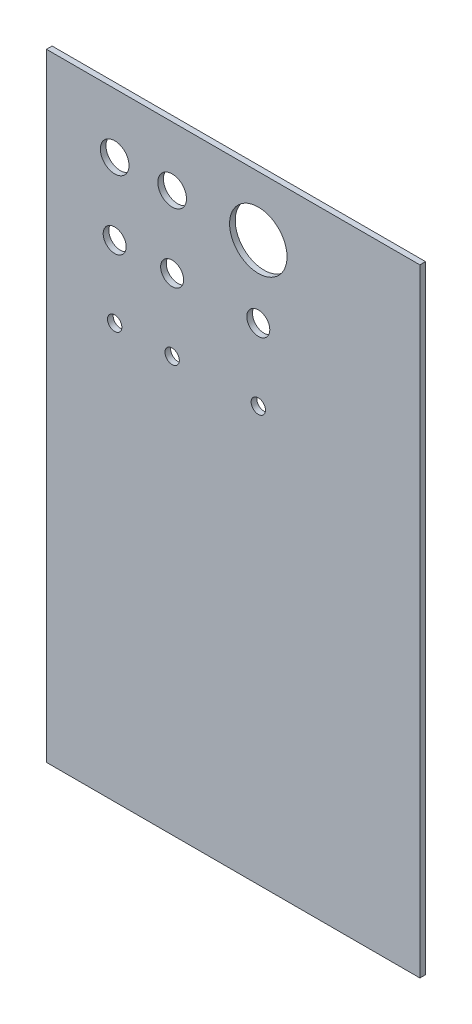
ISO-10303-21;
HEADER;
FILE_DESCRIPTION(('STEP AP214'),'2;1');
FILE_NAME('part.step','',(''),(''),'','','');
FILE_SCHEMA(('AUTOMOTIVE_DESIGN { 1 0 10303 214 1 1 1 1 }'));
ENDSEC;
DATA;
#1=APPLICATION_CONTEXT('core data for automotive mechanical design processes');
#2=APPLICATION_PROTOCOL_DEFINITION('international standard','automotive_design',2000,#1);
#3=PRODUCT_CONTEXT('',#1,'mechanical');
#4=PRODUCT('Part','Part','',(#3));
#5=PRODUCT_RELATED_PRODUCT_CATEGORY('part','',(#4));
#6=PRODUCT_DEFINITION_FORMATION('','',#4);
#7=PRODUCT_DEFINITION_CONTEXT('part definition',#1,'design');
#8=PRODUCT_DEFINITION('design','',#6,#7);
#9=PRODUCT_DEFINITION_SHAPE('','',#8);
#10=(LENGTH_UNIT() NAMED_UNIT(*) SI_UNIT(.MILLI.,.METRE.));
#11=(NAMED_UNIT(*) PLANE_ANGLE_UNIT() SI_UNIT($,.RADIAN.));
#12=(NAMED_UNIT(*) SI_UNIT($,.STERADIAN.) SOLID_ANGLE_UNIT());
#13=UNCERTAINTY_MEASURE_WITH_UNIT(LENGTH_MEASURE(1.E-05),#10,'distance_accuracy_value','');
#14=(GEOMETRIC_REPRESENTATION_CONTEXT(3) GLOBAL_UNCERTAINTY_ASSIGNED_CONTEXT((#13)) GLOBAL_UNIT_ASSIGNED_CONTEXT((#10,
#11,#12)) REPRESENTATION_CONTEXT('',''));
#15=CARTESIAN_POINT('',(0.,0.,0.));
#16=DIRECTION('',(0.,0.,1.));
#17=DIRECTION('',(1.,0.,0.));
#18=AXIS2_PLACEMENT_3D('',#15,#16,#17);
#19=CARTESIAN_POINT('',(1590.25088137465,2574.43204696113,26.));
#20=DIRECTION('',(0.,0.,-1.));
#21=DIRECTION('',(-1.,0.,0.));
#22=AXIS2_PLACEMENT_3D('',#19,#20,#21);
#23=PLANE('',#22);
#24=DIRECTION('',(1.,0.,0.));
#25=VECTOR('',#24,1.);
#26=CARTESIAN_POINT('',(1722.33088137465,2574.43204696113,26.));
#27=LINE('',#26,#25);
#28=CARTESIAN_POINT('',(1590.25088137465,2574.43204696113,26.));
#29=VERTEX_POINT('',#28);
#30=CARTESIAN_POINT('',(1722.33088137465,2574.43204696113,26.));
#31=VERTEX_POINT('',#30);
#32=EDGE_CURVE('E91',#29,#31,#27,.T.);
#33=ORIENTED_EDGE('',*,*,#32,.T.);
#34=DIRECTION('',(0.,1.,0.));
#35=VECTOR('',#34,1.);
#36=CARTESIAN_POINT('',(1722.33088137465,2792.87204696113,26.));
#37=LINE('',#36,#35);
#38=CARTESIAN_POINT('',(1722.33088137465,2792.87204696113,26.));
#39=VERTEX_POINT('',#38);
#40=EDGE_CURVE('E86',#31,#39,#37,.T.);
#41=ORIENTED_EDGE('',*,*,#40,.T.);
#42=DIRECTION('',(-1.,0.,0.));
#43=VECTOR('',#42,1.);
#44=CARTESIAN_POINT('',(1590.25088137465,2792.87204696113,26.));
#45=LINE('',#44,#43);
#46=CARTESIAN_POINT('',(1590.25088137465,2792.87204696113,26.));
#47=VERTEX_POINT('',#46);
#48=EDGE_CURVE('E89',#39,#47,#45,.T.);
#49=ORIENTED_EDGE('',*,*,#48,.T.);
#50=DIRECTION('',(0.,-1.,0.));
#51=VECTOR('',#50,1.);
#52=CARTESIAN_POINT('',(1590.25088137465,2574.43204696113,26.));
#53=LINE('',#52,#51);
#54=EDGE_CURVE('E56',#47,#29,#53,.T.);
#55=ORIENTED_EDGE('',*,*,#54,.T.);
#56=EDGE_LOOP('',(#33,#41,#49,#55));
#57=FACE_BOUND('',#56,.T.);
#58=CARTESIAN_POINT('',(1614.38104088665,2771.84150536977,26.));
#59=DIRECTION('',(0.,0.,1.));
#60=DIRECTION('',(1.,0.,0.));
#61=AXIS2_PLACEMENT_3D('',#58,#59,#60);
#62=CIRCLE('',#61,5.08);
#63=CARTESIAN_POINT('',(1619.46104088665,2771.84150536977,26.));
#64=VERTEX_POINT('',#63);
#65=EDGE_CURVE('E111',#64,#64,#62,.T.);
#66=ORIENTED_EDGE('',*,*,#65,.F.);
#67=EDGE_LOOP('',(#66));
#68=FACE_BOUND('',#67,.T.);
#69=CARTESIAN_POINT('',(1614.38104088665,2746.44150536977,26.));
#70=DIRECTION('',(0.,0.,1.));
#71=DIRECTION('',(1.,0.,0.));
#72=AXIS2_PLACEMENT_3D('',#69,#70,#71);
#73=CIRCLE('',#72,4.064);
#74=CARTESIAN_POINT('',(1618.44504088665,2746.44150536977,26.));
#75=VERTEX_POINT('',#74);
#76=EDGE_CURVE('E133',#75,#75,#73,.T.);
#77=ORIENTED_EDGE('',*,*,#76,.F.);
#78=EDGE_LOOP('',(#77));
#79=FACE_BOUND('',#78,.T.);
#80=CARTESIAN_POINT('',(1614.38104088665,2721.04150536977,26.));
#81=DIRECTION('',(0.,0.,1.));
#82=DIRECTION('',(1.,0.,0.));
#83=AXIS2_PLACEMENT_3D('',#80,#81,#82);
#84=CIRCLE('',#83,2.54);
#85=CARTESIAN_POINT('',(1616.92104088665,2721.04150536977,26.));
#86=VERTEX_POINT('',#85);
#87=EDGE_CURVE('E141',#86,#86,#84,.T.);
#88=ORIENTED_EDGE('',*,*,#87,.F.);
#89=EDGE_LOOP('',(#88));
#90=FACE_BOUND('',#89,.T.);
#91=CARTESIAN_POINT('',(1634.70104088665,2771.84150536977,26.));
#92=DIRECTION('',(0.,0.,1.));
#93=DIRECTION('',(1.,0.,0.));
#94=AXIS2_PLACEMENT_3D('',#91,#92,#93);
#95=CIRCLE('',#94,5.08);
#96=CARTESIAN_POINT('',(1639.78104088665,2771.84150536977,26.));
#97=VERTEX_POINT('',#96);
#98=EDGE_CURVE('E149',#97,#97,#95,.T.);
#99=ORIENTED_EDGE('',*,*,#98,.F.);
#100=EDGE_LOOP('',(#99));
#101=FACE_BOUND('',#100,.T.);
#102=CARTESIAN_POINT('',(1634.70104088665,2746.44150536977,26.));
#103=DIRECTION('',(0.,0.,1.));
#104=DIRECTION('',(1.,0.,0.));
#105=AXIS2_PLACEMENT_3D('',#102,#103,#104);
#106=CIRCLE('',#105,4.064);
#107=CARTESIAN_POINT('',(1638.76504088665,2746.44150536977,26.));
#108=VERTEX_POINT('',#107);
#109=EDGE_CURVE('E157',#108,#108,#106,.T.);
#110=ORIENTED_EDGE('',*,*,#109,.F.);
#111=EDGE_LOOP('',(#110));
#112=FACE_BOUND('',#111,.T.);
#113=CARTESIAN_POINT('',(1634.70104088665,2721.04150536977,26.));
#114=DIRECTION('',(0.,0.,1.));
#115=DIRECTION('',(1.,0.,0.));
#116=AXIS2_PLACEMENT_3D('',#113,#114,#115);
#117=CIRCLE('',#116,2.54);
#118=CARTESIAN_POINT('',(1637.24104088665,2721.04150536977,26.));
#119=VERTEX_POINT('',#118);
#120=EDGE_CURVE('E165',#119,#119,#117,.T.);
#121=ORIENTED_EDGE('',*,*,#120,.F.);
#122=EDGE_LOOP('',(#121));
#123=FACE_BOUND('',#122,.T.);
#124=CARTESIAN_POINT('',(1665.18104088665,2771.84150536977,26.));
#125=DIRECTION('',(0.,0.,1.));
#126=DIRECTION('',(1.,0.,0.));
#127=AXIS2_PLACEMENT_3D('',#124,#125,#126);
#128=CIRCLE('',#127,10.16);
#129=CARTESIAN_POINT('',(1675.34104088665,2771.84150536977,26.));
#130=VERTEX_POINT('',#129);
#131=EDGE_CURVE('E173',#130,#130,#128,.T.);
#132=ORIENTED_EDGE('',*,*,#131,.F.);
#133=EDGE_LOOP('',(#132));
#134=FACE_BOUND('',#133,.T.);
#135=CARTESIAN_POINT('',(1665.18104088665,2746.44150536977,26.));
#136=DIRECTION('',(0.,0.,1.));
#137=DIRECTION('',(1.,0.,0.));
#138=AXIS2_PLACEMENT_3D('',#135,#136,#137);
#139=CIRCLE('',#138,4.064);
#140=CARTESIAN_POINT('',(1669.24504088665,2746.44150536977,26.));
#141=VERTEX_POINT('',#140);
#142=EDGE_CURVE('E181',#141,#141,#139,.T.);
#143=ORIENTED_EDGE('',*,*,#142,.F.);
#144=EDGE_LOOP('',(#143));
#145=FACE_BOUND('',#144,.T.);
#146=CARTESIAN_POINT('',(1665.18104088665,2721.04150536977,26.));
#147=DIRECTION('',(0.,0.,1.));
#148=DIRECTION('',(1.,0.,0.));
#149=AXIS2_PLACEMENT_3D('',#146,#147,#148);
#150=CIRCLE('',#149,2.54);
#151=CARTESIAN_POINT('',(1667.72104088665,2721.04150536977,26.));
#152=VERTEX_POINT('',#151);
#153=EDGE_CURVE('E189',#152,#152,#150,.T.);
#154=ORIENTED_EDGE('',*,*,#153,.F.);
#155=EDGE_LOOP('',(#154));
#156=FACE_BOUND('',#155,.T.);
#157=ADVANCED_FACE('F38',(#57,#68,#79,#90,#101,#112,#123,#134,#145,#156),#23,.F.);
#158=CARTESIAN_POINT('',(1590.25088137465,2574.43204696113,24.));
#159=DIRECTION('',(0.,0.,-1.));
#160=DIRECTION('',(-1.,0.,0.));
#161=AXIS2_PLACEMENT_3D('',#158,#159,#160);
#162=PLANE('',#161);
#163=CARTESIAN_POINT('',(1665.18104088665,2746.44150536977,24.));
#164=DIRECTION('',(0.,0.,1.));
#165=DIRECTION('',(1.,0.,0.));
#166=AXIS2_PLACEMENT_3D('',#163,#164,#165);
#167=CIRCLE('',#166,4.064);
#168=CARTESIAN_POINT('',(1669.24504088665,2746.44150536977,24.));
#169=VERTEX_POINT('',#168);
#170=EDGE_CURVE('E185',#169,#169,#167,.T.);
#171=ORIENTED_EDGE('',*,*,#170,.T.);
#172=EDGE_LOOP('',(#171));
#173=FACE_BOUND('',#172,.T.);
#174=CARTESIAN_POINT('',(1634.70104088665,2721.04150536977,24.));
#175=DIRECTION('',(0.,0.,1.));
#176=DIRECTION('',(1.,0.,0.));
#177=AXIS2_PLACEMENT_3D('',#174,#175,#176);
#178=CIRCLE('',#177,2.54);
#179=CARTESIAN_POINT('',(1637.24104088665,2721.04150536977,24.));
#180=VERTEX_POINT('',#179);
#181=EDGE_CURVE('E169',#180,#180,#178,.T.);
#182=ORIENTED_EDGE('',*,*,#181,.T.);
#183=EDGE_LOOP('',(#182));
#184=FACE_BOUND('',#183,.T.);
#185=CARTESIAN_POINT('',(1634.70104088665,2771.84150536977,24.));
#186=DIRECTION('',(0.,0.,1.));
#187=DIRECTION('',(1.,0.,0.));
#188=AXIS2_PLACEMENT_3D('',#185,#186,#187);
#189=CIRCLE('',#188,5.08);
#190=CARTESIAN_POINT('',(1639.78104088665,2771.84150536977,24.));
#191=VERTEX_POINT('',#190);
#192=EDGE_CURVE('E153',#191,#191,#189,.T.);
#193=ORIENTED_EDGE('',*,*,#192,.T.);
#194=EDGE_LOOP('',(#193));
#195=FACE_BOUND('',#194,.T.);
#196=CARTESIAN_POINT('',(1614.38104088665,2746.44150536977,24.));
#197=DIRECTION('',(0.,0.,1.));
#198=DIRECTION('',(1.,0.,0.));
#199=AXIS2_PLACEMENT_3D('',#196,#197,#198);
#200=CIRCLE('',#199,4.064);
#201=CARTESIAN_POINT('',(1618.44504088665,2746.44150536977,24.));
#202=VERTEX_POINT('',#201);
#203=EDGE_CURVE('E137',#202,#202,#200,.T.);
#204=ORIENTED_EDGE('',*,*,#203,.T.);
#205=EDGE_LOOP('',(#204));
#206=FACE_BOUND('',#205,.T.);
#207=DIRECTION('',(1.,0.,0.));
#208=VECTOR('',#207,1.);
#209=CARTESIAN_POINT('',(1722.33088137465,2574.43204696113,24.));
#210=LINE('',#209,#208);
#211=CARTESIAN_POINT('',(1590.25088137465,2574.43204696113,24.));
#212=VERTEX_POINT('',#211);
#213=CARTESIAN_POINT('',(1722.33088137465,2574.43204696113,24.));
#214=VERTEX_POINT('',#213);
#215=EDGE_CURVE('E107',#212,#214,#210,.T.);
#216=ORIENTED_EDGE('',*,*,#215,.F.);
#217=DIRECTION('',(0.,-1.,0.));
#218=VECTOR('',#217,1.);
#219=CARTESIAN_POINT('',(1590.25088137465,2574.43204696113,24.));
#220=LINE('',#219,#218);
#221=CARTESIAN_POINT('',(1590.25088137465,2792.87204696113,24.));
#222=VERTEX_POINT('',#221);
#223=EDGE_CURVE('E79',#222,#212,#220,.T.);
#224=ORIENTED_EDGE('',*,*,#223,.F.);
#225=DIRECTION('',(-1.,0.,0.));
#226=VECTOR('',#225,1.);
#227=CARTESIAN_POINT('',(1590.25088137465,2792.87204696113,24.));
#228=LINE('',#227,#226);
#229=CARTESIAN_POINT('',(1722.33088137465,2792.87204696113,24.));
#230=VERTEX_POINT('',#229);
#231=EDGE_CURVE('E73',#230,#222,#228,.T.);
#232=ORIENTED_EDGE('',*,*,#231,.F.);
#233=DIRECTION('',(0.,1.,0.));
#234=VECTOR('',#233,1.);
#235=CARTESIAN_POINT('',(1722.33088137465,2792.87204696113,24.));
#236=LINE('',#235,#234);
#237=EDGE_CURVE('E96',#214,#230,#236,.T.);
#238=ORIENTED_EDGE('',*,*,#237,.F.);
#239=EDGE_LOOP('',(#216,#224,#232,#238));
#240=FACE_BOUND('',#239,.T.);
#241=CARTESIAN_POINT('',(1614.38104088665,2771.84150536977,24.));
#242=DIRECTION('',(0.,0.,1.));
#243=DIRECTION('',(1.,0.,0.));
#244=AXIS2_PLACEMENT_3D('',#241,#242,#243);
#245=CIRCLE('',#244,5.08);
#246=CARTESIAN_POINT('',(1619.46104088665,2771.84150536977,24.));
#247=VERTEX_POINT('',#246);
#248=EDGE_CURVE('E129',#247,#247,#245,.T.);
#249=ORIENTED_EDGE('',*,*,#248,.T.);
#250=EDGE_LOOP('',(#249));
#251=FACE_BOUND('',#250,.T.);
#252=CARTESIAN_POINT('',(1614.38104088665,2721.04150536977,24.));
#253=DIRECTION('',(0.,0.,1.));
#254=DIRECTION('',(1.,0.,0.));
#255=AXIS2_PLACEMENT_3D('',#252,#253,#254);
#256=CIRCLE('',#255,2.54);
#257=CARTESIAN_POINT('',(1616.92104088665,2721.04150536977,24.));
#258=VERTEX_POINT('',#257);
#259=EDGE_CURVE('E145',#258,#258,#256,.T.);
#260=ORIENTED_EDGE('',*,*,#259,.T.);
#261=EDGE_LOOP('',(#260));
#262=FACE_BOUND('',#261,.T.);
#263=CARTESIAN_POINT('',(1634.70104088665,2746.44150536977,24.));
#264=DIRECTION('',(0.,0.,1.));
#265=DIRECTION('',(1.,0.,0.));
#266=AXIS2_PLACEMENT_3D('',#263,#264,#265);
#267=CIRCLE('',#266,4.064);
#268=CARTESIAN_POINT('',(1638.76504088665,2746.44150536977,24.));
#269=VERTEX_POINT('',#268);
#270=EDGE_CURVE('E161',#269,#269,#267,.T.);
#271=ORIENTED_EDGE('',*,*,#270,.T.);
#272=EDGE_LOOP('',(#271));
#273=FACE_BOUND('',#272,.T.);
#274=CARTESIAN_POINT('',(1665.18104088665,2771.84150536977,24.));
#275=DIRECTION('',(0.,0.,1.));
#276=DIRECTION('',(1.,0.,0.));
#277=AXIS2_PLACEMENT_3D('',#274,#275,#276);
#278=CIRCLE('',#277,10.16);
#279=CARTESIAN_POINT('',(1675.34104088665,2771.84150536977,24.));
#280=VERTEX_POINT('',#279);
#281=EDGE_CURVE('E177',#280,#280,#278,.T.);
#282=ORIENTED_EDGE('',*,*,#281,.T.);
#283=EDGE_LOOP('',(#282));
#284=FACE_BOUND('',#283,.T.);
#285=CARTESIAN_POINT('',(1665.18104088665,2721.04150536977,24.));
#286=DIRECTION('',(0.,0.,1.));
#287=DIRECTION('',(1.,0.,0.));
#288=AXIS2_PLACEMENT_3D('',#285,#286,#287);
#289=CIRCLE('',#288,2.54);
#290=CARTESIAN_POINT('',(1667.72104088665,2721.04150536977,24.));
#291=VERTEX_POINT('',#290);
#292=EDGE_CURVE('E193',#291,#291,#289,.T.);
#293=ORIENTED_EDGE('',*,*,#292,.T.);
#294=EDGE_LOOP('',(#293));
#295=FACE_BOUND('',#294,.T.);
#296=ADVANCED_FACE('F124',(#173,#184,#195,#206,#240,#251,#262,#273,#284,#295),#162,.T.);
#297=CARTESIAN_POINT('',(1722.33088137465,2574.43204696113,26.));
#298=DIRECTION('',(0.,1.,0.));
#299=DIRECTION('',(0.,0.,1.));
#300=AXIS2_PLACEMENT_3D('',#297,#298,#299);
#301=PLANE('',#300);
#302=ORIENTED_EDGE('',*,*,#215,.T.);
#303=DIRECTION('',(0.,0.,-1.));
#304=VECTOR('',#303,1.);
#305=CARTESIAN_POINT('',(1722.33088137465,2574.43204696113,26.));
#306=LINE('',#305,#304);
#307=EDGE_CURVE('E11',#31,#214,#306,.T.);
#308=ORIENTED_EDGE('',*,*,#307,.F.);
#309=ORIENTED_EDGE('',*,*,#32,.F.);
#310=DIRECTION('',(0.,0.,-1.));
#311=VECTOR('',#310,1.);
#312=CARTESIAN_POINT('',(1590.25088137465,2574.43204696113,26.));
#313=LINE('',#312,#311);
#314=EDGE_CURVE('E103',#29,#212,#313,.T.);
#315=ORIENTED_EDGE('',*,*,#314,.T.);
#316=EDGE_LOOP('',(#302,#308,#309,#315));
#317=FACE_BOUND('',#316,.T.);
#318=ADVANCED_FACE('F40',(#317),#301,.F.);
#319=CARTESIAN_POINT('',(1722.33088137465,2792.87204696113,26.));
#320=DIRECTION('',(-1.,0.,0.));
#321=DIRECTION('',(0.,0.,1.));
#322=AXIS2_PLACEMENT_3D('',#319,#320,#321);
#323=PLANE('',#322);
#324=ORIENTED_EDGE('',*,*,#237,.T.);
#325=DIRECTION('',(0.,0.,-1.));
#326=VECTOR('',#325,1.);
#327=CARTESIAN_POINT('',(1722.33088137465,2792.87204696113,26.));
#328=LINE('',#327,#326);
#329=EDGE_CURVE('E48',#39,#230,#328,.T.);
#330=ORIENTED_EDGE('',*,*,#329,.F.);
#331=ORIENTED_EDGE('',*,*,#40,.F.);
#332=ORIENTED_EDGE('',*,*,#307,.T.);
#333=EDGE_LOOP('',(#324,#330,#331,#332));
#334=FACE_BOUND('',#333,.T.);
#335=ADVANCED_FACE('F95',(#334),#323,.F.);
#336=CARTESIAN_POINT('',(1590.25088137465,2792.87204696113,26.));
#337=DIRECTION('',(0.,-1.,0.));
#338=DIRECTION('',(0.,0.,-1.));
#339=AXIS2_PLACEMENT_3D('',#336,#337,#338);
#340=PLANE('',#339);
#341=ORIENTED_EDGE('',*,*,#231,.T.);
#342=DIRECTION('',(0.,0.,-1.));
#343=VECTOR('',#342,1.);
#344=CARTESIAN_POINT('',(1590.25088137465,2792.87204696113,26.));
#345=LINE('',#344,#343);
#346=EDGE_CURVE('E98',#47,#222,#345,.T.);
#347=ORIENTED_EDGE('',*,*,#346,.F.);
#348=ORIENTED_EDGE('',*,*,#48,.F.);
#349=ORIENTED_EDGE('',*,*,#329,.T.);
#350=EDGE_LOOP('',(#341,#347,#348,#349));
#351=FACE_BOUND('',#350,.T.);
#352=ADVANCED_FACE('F99',(#351),#340,.F.);
#353=CARTESIAN_POINT('',(1590.25088137465,2574.43204696113,26.));
#354=DIRECTION('',(1.,0.,0.));
#355=DIRECTION('',(0.,0.,-1.));
#356=AXIS2_PLACEMENT_3D('',#353,#354,#355);
#357=PLANE('',#356);
#358=ORIENTED_EDGE('',*,*,#223,.T.);
#359=ORIENTED_EDGE('',*,*,#314,.F.);
#360=ORIENTED_EDGE('',*,*,#54,.F.);
#361=ORIENTED_EDGE('',*,*,#346,.T.);
#362=EDGE_LOOP('',(#358,#359,#360,#361));
#363=FACE_BOUND('',#362,.T.);
#364=ADVANCED_FACE('F121',(#363),#357,.F.);
#365=CARTESIAN_POINT('',(1614.38104088665,2771.84150536977,26.));
#366=DIRECTION('',(0.,0.,-1.));
#367=DIRECTION('',(-1.,0.,0.));
#368=AXIS2_PLACEMENT_3D('',#365,#366,#367);
#369=CYLINDRICAL_SURFACE('',#368,5.08);
#370=ORIENTED_EDGE('',*,*,#65,.T.);
#371=EDGE_LOOP('',(#370));
#372=FACE_BOUND('',#371,.T.);
#373=ORIENTED_EDGE('',*,*,#248,.F.);
#374=EDGE_LOOP('',(#373));
#375=FACE_BOUND('',#374,.T.);
#376=ADVANCED_FACE('F212',(#372,#375),#369,.F.);
#377=CARTESIAN_POINT('',(1614.38104088665,2746.44150536977,26.));
#378=DIRECTION('',(0.,0.,-1.));
#379=DIRECTION('',(-1.,0.,0.));
#380=AXIS2_PLACEMENT_3D('',#377,#378,#379);
#381=CYLINDRICAL_SURFACE('',#380,4.064);
#382=ORIENTED_EDGE('',*,*,#76,.T.);
#383=EDGE_LOOP('',(#382));
#384=FACE_BOUND('',#383,.T.);
#385=ORIENTED_EDGE('',*,*,#203,.F.);
#386=EDGE_LOOP('',(#385));
#387=FACE_BOUND('',#386,.T.);
#388=ADVANCED_FACE('F258',(#384,#387),#381,.F.);
#389=CARTESIAN_POINT('',(1614.38104088665,2721.04150536977,26.));
#390=DIRECTION('',(0.,0.,-1.));
#391=DIRECTION('',(-1.,0.,0.));
#392=AXIS2_PLACEMENT_3D('',#389,#390,#391);
#393=CYLINDRICAL_SURFACE('',#392,2.54);
#394=ORIENTED_EDGE('',*,*,#87,.T.);
#395=EDGE_LOOP('',(#394));
#396=FACE_BOUND('',#395,.T.);
#397=ORIENTED_EDGE('',*,*,#259,.F.);
#398=EDGE_LOOP('',(#397));
#399=FACE_BOUND('',#398,.T.);
#400=ADVANCED_FACE('F266',(#396,#399),#393,.F.);
#401=CARTESIAN_POINT('',(1634.70104088665,2771.84150536977,26.));
#402=DIRECTION('',(0.,0.,-1.));
#403=DIRECTION('',(-1.,0.,0.));
#404=AXIS2_PLACEMENT_3D('',#401,#402,#403);
#405=CYLINDRICAL_SURFACE('',#404,5.08);
#406=ORIENTED_EDGE('',*,*,#98,.T.);
#407=EDGE_LOOP('',(#406));
#408=FACE_BOUND('',#407,.T.);
#409=ORIENTED_EDGE('',*,*,#192,.F.);
#410=EDGE_LOOP('',(#409));
#411=FACE_BOUND('',#410,.T.);
#412=ADVANCED_FACE('F274',(#408,#411),#405,.F.);
#413=CARTESIAN_POINT('',(1634.70104088665,2746.44150536977,26.));
#414=DIRECTION('',(0.,0.,-1.));
#415=DIRECTION('',(-1.,0.,0.));
#416=AXIS2_PLACEMENT_3D('',#413,#414,#415);
#417=CYLINDRICAL_SURFACE('',#416,4.064);
#418=ORIENTED_EDGE('',*,*,#109,.T.);
#419=EDGE_LOOP('',(#418));
#420=FACE_BOUND('',#419,.T.);
#421=ORIENTED_EDGE('',*,*,#270,.F.);
#422=EDGE_LOOP('',(#421));
#423=FACE_BOUND('',#422,.T.);
#424=ADVANCED_FACE('F283',(#420,#423),#417,.F.);
#425=CARTESIAN_POINT('',(1634.70104088665,2721.04150536977,26.));
#426=DIRECTION('',(0.,0.,-1.));
#427=DIRECTION('',(-1.,0.,0.));
#428=AXIS2_PLACEMENT_3D('',#425,#426,#427);
#429=CYLINDRICAL_SURFACE('',#428,2.54);
#430=ORIENTED_EDGE('',*,*,#120,.T.);
#431=EDGE_LOOP('',(#430));
#432=FACE_BOUND('',#431,.T.);
#433=ORIENTED_EDGE('',*,*,#181,.F.);
#434=EDGE_LOOP('',(#433));
#435=FACE_BOUND('',#434,.T.);
#436=ADVANCED_FACE('F292',(#432,#435),#429,.F.);
#437=CARTESIAN_POINT('',(1665.18104088665,2771.84150536977,26.));
#438=DIRECTION('',(0.,0.,-1.));
#439=DIRECTION('',(-1.,0.,0.));
#440=AXIS2_PLACEMENT_3D('',#437,#438,#439);
#441=CYLINDRICAL_SURFACE('',#440,10.16);
#442=ORIENTED_EDGE('',*,*,#131,.T.);
#443=EDGE_LOOP('',(#442));
#444=FACE_BOUND('',#443,.T.);
#445=ORIENTED_EDGE('',*,*,#281,.F.);
#446=EDGE_LOOP('',(#445));
#447=FACE_BOUND('',#446,.T.);
#448=ADVANCED_FACE('F301',(#444,#447),#441,.F.);
#449=CARTESIAN_POINT('',(1665.18104088665,2746.44150536977,26.));
#450=DIRECTION('',(0.,0.,-1.));
#451=DIRECTION('',(-1.,0.,0.));
#452=AXIS2_PLACEMENT_3D('',#449,#450,#451);
#453=CYLINDRICAL_SURFACE('',#452,4.064);
#454=ORIENTED_EDGE('',*,*,#142,.T.);
#455=EDGE_LOOP('',(#454));
#456=FACE_BOUND('',#455,.T.);
#457=ORIENTED_EDGE('',*,*,#170,.F.);
#458=EDGE_LOOP('',(#457));
#459=FACE_BOUND('',#458,.T.);
#460=ADVANCED_FACE('F310',(#456,#459),#453,.F.);
#461=CARTESIAN_POINT('',(1665.18104088665,2721.04150536977,26.));
#462=DIRECTION('',(0.,0.,-1.));
#463=DIRECTION('',(-1.,0.,0.));
#464=AXIS2_PLACEMENT_3D('',#461,#462,#463);
#465=CYLINDRICAL_SURFACE('',#464,2.54);
#466=ORIENTED_EDGE('',*,*,#153,.T.);
#467=EDGE_LOOP('',(#466));
#468=FACE_BOUND('',#467,.T.);
#469=ORIENTED_EDGE('',*,*,#292,.F.);
#470=EDGE_LOOP('',(#469));
#471=FACE_BOUND('',#470,.T.);
#472=ADVANCED_FACE('F201',(#468,#471),#465,.F.);
#473=CLOSED_SHELL('',(#157,#296,#318,#335,#352,#364,#376,#388,#400,#412,#424,#436,#448,#460,#472));
#474=MANIFOLD_SOLID_BREP('B2',#473);
#475=ADVANCED_BREP_SHAPE_REPRESENTATION('',(#18,#474),#14);
#476=SHAPE_DEFINITION_REPRESENTATION(#9,#475);
ENDSEC;
END-ISO-10303-21;
